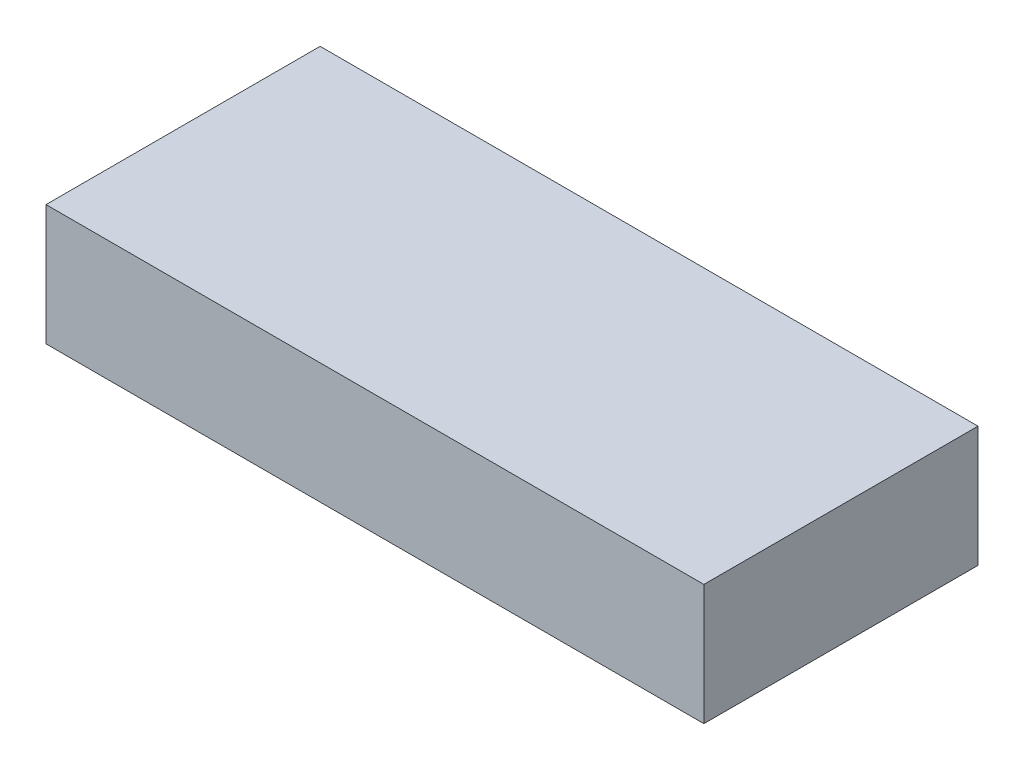
ISO-10303-21;
HEADER;
FILE_DESCRIPTION(('STEP AP214'),'2;1');
FILE_NAME('part.step','',(''),(''),'','','');
FILE_SCHEMA(('AUTOMOTIVE_DESIGN { 1 0 10303 214 1 1 1 1 }'));
ENDSEC;
DATA;
#1=APPLICATION_CONTEXT('core data for automotive mechanical design processes');
#2=APPLICATION_PROTOCOL_DEFINITION('international standard','automotive_design',2000,#1);
#3=PRODUCT_CONTEXT('',#1,'mechanical');
#4=PRODUCT('Part','Part','',(#3));
#5=PRODUCT_RELATED_PRODUCT_CATEGORY('part','',(#4));
#6=PRODUCT_DEFINITION_FORMATION('','',#4);
#7=PRODUCT_DEFINITION_CONTEXT('part definition',#1,'design');
#8=PRODUCT_DEFINITION('design','',#6,#7);
#9=PRODUCT_DEFINITION_SHAPE('','',#8);
#10=(LENGTH_UNIT() NAMED_UNIT(*) SI_UNIT(.MILLI.,.METRE.));
#11=(NAMED_UNIT(*) PLANE_ANGLE_UNIT() SI_UNIT($,.RADIAN.));
#12=(NAMED_UNIT(*) SI_UNIT($,.STERADIAN.) SOLID_ANGLE_UNIT());
#13=UNCERTAINTY_MEASURE_WITH_UNIT(LENGTH_MEASURE(1.E-05),#10,'distance_accuracy_value','');
#14=(GEOMETRIC_REPRESENTATION_CONTEXT(3) GLOBAL_UNCERTAINTY_ASSIGNED_CONTEXT((#13)) GLOBAL_UNIT_ASSIGNED_CONTEXT((#10,
#11,#12)) REPRESENTATION_CONTEXT('',''));
#15=CARTESIAN_POINT('',(0.,0.,0.));
#16=DIRECTION('',(0.,0.,1.));
#17=DIRECTION('',(1.,0.,0.));
#18=AXIS2_PLACEMENT_3D('',#15,#16,#17);
#19=CARTESIAN_POINT('',(0.,11.,0.));
#20=DIRECTION('',(1.,0.,0.));
#21=DIRECTION('',(0.,0.,-1.));
#22=AXIS2_PLACEMENT_3D('',#19,#20,#21);
#23=PLANE('',#22);
#24=DIRECTION('',(0.,0.,1.));
#25=VECTOR('',#24,1.);
#26=CARTESIAN_POINT('',(0.,0.,0.));
#27=LINE('',#26,#25);
#28=CARTESIAN_POINT('',(0.,0.,0.));
#29=VERTEX_POINT('',#28);
#30=CARTESIAN_POINT('',(0.,0.,25.));
#31=VERTEX_POINT('',#30);
#32=EDGE_CURVE('E96',#29,#31,#27,.T.);
#33=ORIENTED_EDGE('',*,*,#32,.T.);
#34=DIRECTION('',(0.,-1.,0.));
#35=VECTOR('',#34,1.);
#36=CARTESIAN_POINT('',(0.,11.,25.));
#37=LINE('',#36,#35);
#38=CARTESIAN_POINT('',(0.,11.,25.));
#39=VERTEX_POINT('',#38);
#40=EDGE_CURVE('E11',#39,#31,#37,.T.);
#41=ORIENTED_EDGE('',*,*,#40,.F.);
#42=DIRECTION('',(0.,0.,1.));
#43=VECTOR('',#42,1.);
#44=CARTESIAN_POINT('',(0.,11.,0.));
#45=LINE('',#44,#43);
#46=CARTESIAN_POINT('',(0.,11.,0.));
#47=VERTEX_POINT('',#46);
#48=EDGE_CURVE('E84',#47,#39,#45,.T.);
#49=ORIENTED_EDGE('',*,*,#48,.F.);
#50=DIRECTION('',(0.,-1.,0.));
#51=VECTOR('',#50,1.);
#52=CARTESIAN_POINT('',(0.,11.,0.));
#53=LINE('',#52,#51);
#54=EDGE_CURVE('E92',#47,#29,#53,.T.);
#55=ORIENTED_EDGE('',*,*,#54,.T.);
#56=EDGE_LOOP('',(#33,#41,#49,#55));
#57=FACE_BOUND('',#56,.T.);
#58=ADVANCED_FACE('F33',(#57),#23,.F.);
#59=CARTESIAN_POINT('',(0.,11.,25.));
#60=DIRECTION('',(0.,0.,-1.));
#61=DIRECTION('',(-1.,0.,0.));
#62=AXIS2_PLACEMENT_3D('',#59,#60,#61);
#63=PLANE('',#62);
#64=DIRECTION('',(1.,0.,0.));
#65=VECTOR('',#64,1.);
#66=CARTESIAN_POINT('',(0.,0.,25.));
#67=LINE('',#66,#65);
#68=CARTESIAN_POINT('',(60.,0.,25.));
#69=VERTEX_POINT('',#68);
#70=EDGE_CURVE('E88',#31,#69,#67,.T.);
#71=ORIENTED_EDGE('',*,*,#70,.T.);
#72=DIRECTION('',(0.,-1.,0.));
#73=VECTOR('',#72,1.);
#74=CARTESIAN_POINT('',(60.,11.,25.));
#75=LINE('',#74,#73);
#76=CARTESIAN_POINT('',(60.,11.,25.));
#77=VERTEX_POINT('',#76);
#78=EDGE_CURVE('E41',#77,#69,#75,.T.);
#79=ORIENTED_EDGE('',*,*,#78,.F.);
#80=DIRECTION('',(1.,0.,0.));
#81=VECTOR('',#80,1.);
#82=CARTESIAN_POINT('',(0.,11.,25.));
#83=LINE('',#82,#81);
#84=EDGE_CURVE('E79',#39,#77,#83,.T.);
#85=ORIENTED_EDGE('',*,*,#84,.F.);
#86=ORIENTED_EDGE('',*,*,#40,.T.);
#87=EDGE_LOOP('',(#71,#79,#85,#86));
#88=FACE_BOUND('',#87,.T.);
#89=ADVANCED_FACE('F87',(#88),#63,.F.);
#90=CARTESIAN_POINT('',(60.,11.,0.));
#91=DIRECTION('',(-1.,0.,0.));
#92=DIRECTION('',(0.,0.,1.));
#93=AXIS2_PLACEMENT_3D('',#90,#91,#92);
#94=PLANE('',#93);
#95=DIRECTION('',(0.,0.,-1.));
#96=VECTOR('',#95,1.);
#97=CARTESIAN_POINT('',(60.,0.,0.));
#98=LINE('',#97,#96);
#99=CARTESIAN_POINT('',(60.,0.,0.));
#100=VERTEX_POINT('',#99);
#101=EDGE_CURVE('E66',#69,#100,#98,.T.);
#102=ORIENTED_EDGE('',*,*,#101,.T.);
#103=DIRECTION('',(0.,-1.,0.));
#104=VECTOR('',#103,1.);
#105=CARTESIAN_POINT('',(60.,11.,0.));
#106=LINE('',#105,#104);
#107=CARTESIAN_POINT('',(60.,11.,0.));
#108=VERTEX_POINT('',#107);
#109=EDGE_CURVE('E89',#108,#100,#106,.T.);
#110=ORIENTED_EDGE('',*,*,#109,.F.);
#111=DIRECTION('',(0.,0.,-1.));
#112=VECTOR('',#111,1.);
#113=CARTESIAN_POINT('',(60.,11.,0.));
#114=LINE('',#113,#112);
#115=EDGE_CURVE('E82',#77,#108,#114,.T.);
#116=ORIENTED_EDGE('',*,*,#115,.F.);
#117=ORIENTED_EDGE('',*,*,#78,.T.);
#118=EDGE_LOOP('',(#102,#110,#116,#117));
#119=FACE_BOUND('',#118,.T.);
#120=ADVANCED_FACE('F90',(#119),#94,.F.);
#121=CARTESIAN_POINT('',(0.,11.,0.));
#122=DIRECTION('',(0.,0.,1.));
#123=DIRECTION('',(1.,0.,0.));
#124=AXIS2_PLACEMENT_3D('',#121,#122,#123);
#125=PLANE('',#124);
#126=DIRECTION('',(-1.,0.,0.));
#127=VECTOR('',#126,1.);
#128=CARTESIAN_POINT('',(0.,0.,0.));
#129=LINE('',#128,#127);
#130=EDGE_CURVE('E72',#100,#29,#129,.T.);
#131=ORIENTED_EDGE('',*,*,#130,.T.);
#132=ORIENTED_EDGE('',*,*,#54,.F.);
#133=DIRECTION('',(-1.,0.,0.));
#134=VECTOR('',#133,1.);
#135=CARTESIAN_POINT('',(0.,11.,0.));
#136=LINE('',#135,#134);
#137=EDGE_CURVE('E49',#108,#47,#136,.T.);
#138=ORIENTED_EDGE('',*,*,#137,.F.);
#139=ORIENTED_EDGE('',*,*,#109,.T.);
#140=EDGE_LOOP('',(#131,#132,#138,#139));
#141=FACE_BOUND('',#140,.T.);
#142=ADVANCED_FACE('F103',(#141),#125,.F.);
#143=CARTESIAN_POINT('',(0.,11.,0.));
#144=DIRECTION('',(0.,1.,0.));
#145=DIRECTION('',(0.,0.,1.));
#146=AXIS2_PLACEMENT_3D('',#143,#144,#145);
#147=PLANE('',#146);
#148=ORIENTED_EDGE('',*,*,#48,.T.);
#149=ORIENTED_EDGE('',*,*,#84,.T.);
#150=ORIENTED_EDGE('',*,*,#115,.T.);
#151=ORIENTED_EDGE('',*,*,#137,.T.);
#152=EDGE_LOOP('',(#148,#149,#150,#151));
#153=FACE_BOUND('',#152,.T.);
#154=ADVANCED_FACE('F80',(#153),#147,.T.);
#155=CARTESIAN_POINT('',(0.,0.,0.));
#156=DIRECTION('',(0.,1.,0.));
#157=DIRECTION('',(0.,0.,1.));
#158=AXIS2_PLACEMENT_3D('',#155,#156,#157);
#159=PLANE('',#158);
#160=ORIENTED_EDGE('',*,*,#32,.F.);
#161=ORIENTED_EDGE('',*,*,#130,.F.);
#162=ORIENTED_EDGE('',*,*,#101,.F.);
#163=ORIENTED_EDGE('',*,*,#70,.F.);
#164=EDGE_LOOP('',(#160,#161,#162,#163));
#165=FACE_BOUND('',#164,.T.);
#166=ADVANCED_FACE('F106',(#165),#159,.F.);
#167=CLOSED_SHELL('',(#58,#89,#120,#142,#154,#166));
#168=MANIFOLD_SOLID_BREP('B2',#167);
#169=ADVANCED_BREP_SHAPE_REPRESENTATION('',(#18,#168),#14);
#170=SHAPE_DEFINITION_REPRESENTATION(#9,#169);
ENDSEC;
END-ISO-10303-21;
